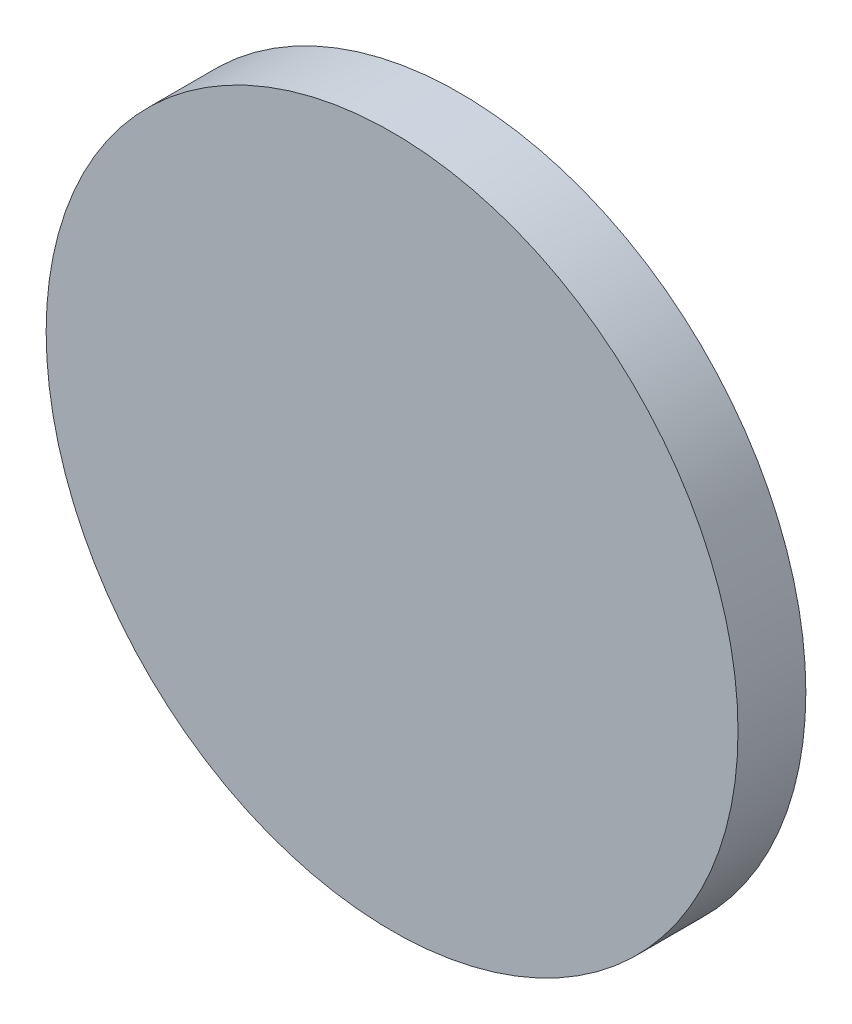
ISO-10303-21;
HEADER;
FILE_DESCRIPTION(('STEP AP214'),'2;1');
FILE_NAME('part.step','',(''),(''),'','','');
FILE_SCHEMA(('AUTOMOTIVE_DESIGN { 1 0 10303 214 1 1 1 1 }'));
ENDSEC;
DATA;
#1=APPLICATION_CONTEXT('core data for automotive mechanical design processes');
#2=APPLICATION_PROTOCOL_DEFINITION('international standard','automotive_design',2000,#1);
#3=PRODUCT_CONTEXT('',#1,'mechanical');
#4=PRODUCT('Part','Part','',(#3));
#5=PRODUCT_RELATED_PRODUCT_CATEGORY('part','',(#4));
#6=PRODUCT_DEFINITION_FORMATION('','',#4);
#7=PRODUCT_DEFINITION_CONTEXT('part definition',#1,'design');
#8=PRODUCT_DEFINITION('design','',#6,#7);
#9=PRODUCT_DEFINITION_SHAPE('','',#8);
#10=(LENGTH_UNIT() NAMED_UNIT(*) SI_UNIT(.MILLI.,.METRE.));
#11=(NAMED_UNIT(*) PLANE_ANGLE_UNIT() SI_UNIT($,.RADIAN.));
#12=(NAMED_UNIT(*) SI_UNIT($,.STERADIAN.) SOLID_ANGLE_UNIT());
#13=UNCERTAINTY_MEASURE_WITH_UNIT(LENGTH_MEASURE(1.E-05),#10,'distance_accuracy_value','');
#14=(GEOMETRIC_REPRESENTATION_CONTEXT(3) GLOBAL_UNCERTAINTY_ASSIGNED_CONTEXT((#13)) GLOBAL_UNIT_ASSIGNED_CONTEXT((#10,
#11,#12)) REPRESENTATION_CONTEXT('',''));
#15=CARTESIAN_POINT('',(0.,0.,0.));
#16=DIRECTION('',(0.,0.,1.));
#17=DIRECTION('',(1.,0.,0.));
#18=AXIS2_PLACEMENT_3D('',#15,#16,#17);
#19=CARTESIAN_POINT('',(0.,0.,2.5));
#20=DIRECTION('',(0.,0.,-1.));
#21=DIRECTION('',(-1.,0.,0.));
#22=AXIS2_PLACEMENT_3D('',#19,#20,#21);
#23=CYLINDRICAL_SURFACE('',#22,12.75);
#24=CARTESIAN_POINT('',(0.,0.,2.5));
#25=DIRECTION('',(0.,0.,1.));
#26=DIRECTION('',(1.,0.,0.));
#27=AXIS2_PLACEMENT_3D('',#24,#25,#26);
#28=CIRCLE('',#27,12.75);
#29=CARTESIAN_POINT('',(12.75,0.,2.5));
#30=VERTEX_POINT('',#29);
#31=EDGE_CURVE('E10',#30,#30,#28,.T.);
#32=ORIENTED_EDGE('',*,*,#31,.F.);
#33=EDGE_LOOP('',(#32));
#34=FACE_BOUND('',#33,.T.);
#35=CARTESIAN_POINT('',(0.,0.,0.));
#36=DIRECTION('',(0.,0.,1.));
#37=DIRECTION('',(1.,0.,0.));
#38=AXIS2_PLACEMENT_3D('',#35,#36,#37);
#39=CIRCLE('',#38,12.75);
#40=CARTESIAN_POINT('',(12.75,0.,0.));
#41=VERTEX_POINT('',#40);
#42=EDGE_CURVE('E35',#41,#41,#39,.T.);
#43=ORIENTED_EDGE('',*,*,#42,.T.);
#44=EDGE_LOOP('',(#43));
#45=FACE_BOUND('',#44,.T.);
#46=ADVANCED_FACE('F32',(#34,#45),#23,.T.);
#47=CARTESIAN_POINT('',(0.,0.,2.5));
#48=DIRECTION('',(0.,0.,1.));
#49=DIRECTION('',(1.,0.,0.));
#50=AXIS2_PLACEMENT_3D('',#47,#48,#49);
#51=PLANE('',#50);
#52=ORIENTED_EDGE('',*,*,#31,.T.);
#53=EDGE_LOOP('',(#52));
#54=FACE_BOUND('',#53,.T.);
#55=ADVANCED_FACE('F47',(#54),#51,.T.);
#56=CARTESIAN_POINT('',(0.,0.,0.));
#57=DIRECTION('',(0.,0.,1.));
#58=DIRECTION('',(1.,0.,0.));
#59=AXIS2_PLACEMENT_3D('',#56,#57,#58);
#60=PLANE('',#59);
#61=ORIENTED_EDGE('',*,*,#42,.F.);
#62=EDGE_LOOP('',(#61));
#63=FACE_BOUND('',#62,.T.);
#64=ADVANCED_FACE('F45',(#63),#60,.F.);
#65=CLOSED_SHELL('',(#46,#55,#64));
#66=MANIFOLD_SOLID_BREP('B2',#65);
#67=ADVANCED_BREP_SHAPE_REPRESENTATION('',(#18,#66),#14);
#68=SHAPE_DEFINITION_REPRESENTATION(#9,#67);
ENDSEC;
END-ISO-10303-21;
